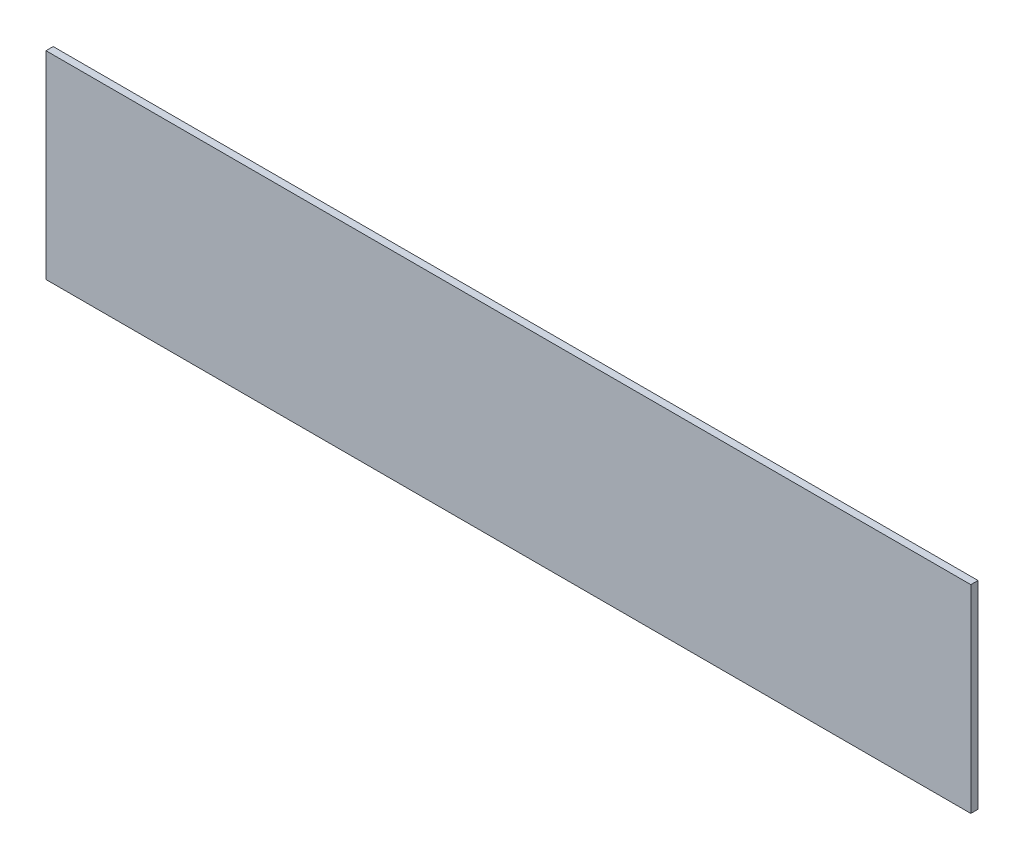
ISO-10303-21;
HEADER;
FILE_DESCRIPTION(('STEP AP214'),'2;1');
FILE_NAME('part.step','',(''),(''),'','','');
FILE_SCHEMA(('AUTOMOTIVE_DESIGN { 1 0 10303 214 1 1 1 1 }'));
ENDSEC;
DATA;
#1=APPLICATION_CONTEXT('core data for automotive mechanical design processes');
#2=APPLICATION_PROTOCOL_DEFINITION('international standard','automotive_design',2000,#1);
#3=PRODUCT_CONTEXT('',#1,'mechanical');
#4=PRODUCT('Part','Part','',(#3));
#5=PRODUCT_RELATED_PRODUCT_CATEGORY('part','',(#4));
#6=PRODUCT_DEFINITION_FORMATION('','',#4);
#7=PRODUCT_DEFINITION_CONTEXT('part definition',#1,'design');
#8=PRODUCT_DEFINITION('design','',#6,#7);
#9=PRODUCT_DEFINITION_SHAPE('','',#8);
#10=(LENGTH_UNIT() NAMED_UNIT(*) SI_UNIT(.MILLI.,.METRE.));
#11=(NAMED_UNIT(*) PLANE_ANGLE_UNIT() SI_UNIT($,.RADIAN.));
#12=(NAMED_UNIT(*) SI_UNIT($,.STERADIAN.) SOLID_ANGLE_UNIT());
#13=UNCERTAINTY_MEASURE_WITH_UNIT(LENGTH_MEASURE(1.E-05),#10,'distance_accuracy_value','');
#14=(GEOMETRIC_REPRESENTATION_CONTEXT(3) GLOBAL_UNCERTAINTY_ASSIGNED_CONTEXT((#13)) GLOBAL_UNIT_ASSIGNED_CONTEXT((#10,
#11,#12)) REPRESENTATION_CONTEXT('',''));
#15=CARTESIAN_POINT('',(0.,0.,0.));
#16=DIRECTION('',(0.,0.,1.));
#17=DIRECTION('',(1.,0.,0.));
#18=AXIS2_PLACEMENT_3D('',#15,#16,#17);
#19=CARTESIAN_POINT('',(0.,0.,3.));
#20=DIRECTION('',(1.,0.,0.));
#21=DIRECTION('',(0.,0.,-1.));
#22=AXIS2_PLACEMENT_3D('',#19,#20,#21);
#23=PLANE('',#22);
#24=DIRECTION('',(0.,-1.,0.));
#25=VECTOR('',#24,1.);
#26=CARTESIAN_POINT('',(0.,0.,0.));
#27=LINE('',#26,#25);
#28=CARTESIAN_POINT('',(0.,82.5,0.));
#29=VERTEX_POINT('',#28);
#30=CARTESIAN_POINT('',(0.,0.,0.));
#31=VERTEX_POINT('',#30);
#32=EDGE_CURVE('E97',#29,#31,#27,.T.);
#33=ORIENTED_EDGE('',*,*,#32,.T.);
#34=DIRECTION('',(0.,0.,-1.));
#35=VECTOR('',#34,1.);
#36=CARTESIAN_POINT('',(0.,0.,3.));
#37=LINE('',#36,#35);
#38=CARTESIAN_POINT('',(0.,0.,3.));
#39=VERTEX_POINT('',#38);
#40=EDGE_CURVE('E11',#39,#31,#37,.T.);
#41=ORIENTED_EDGE('',*,*,#40,.F.);
#42=DIRECTION('',(0.,-1.,0.));
#43=VECTOR('',#42,1.);
#44=CARTESIAN_POINT('',(0.,0.,3.));
#45=LINE('',#44,#43);
#46=CARTESIAN_POINT('',(0.,82.5,3.));
#47=VERTEX_POINT('',#46);
#48=EDGE_CURVE('E85',#47,#39,#45,.T.);
#49=ORIENTED_EDGE('',*,*,#48,.F.);
#50=DIRECTION('',(0.,0.,-1.));
#51=VECTOR('',#50,1.);
#52=CARTESIAN_POINT('',(0.,82.5,3.));
#53=LINE('',#52,#51);
#54=EDGE_CURVE('E93',#47,#29,#53,.T.);
#55=ORIENTED_EDGE('',*,*,#54,.T.);
#56=EDGE_LOOP('',(#33,#41,#49,#55));
#57=FACE_BOUND('',#56,.T.);
#58=ADVANCED_FACE('F34',(#57),#23,.F.);
#59=CARTESIAN_POINT('',(0.,0.,3.));
#60=DIRECTION('',(0.,1.,0.));
#61=DIRECTION('',(0.,0.,1.));
#62=AXIS2_PLACEMENT_3D('',#59,#60,#61);
#63=PLANE('',#62);
#64=DIRECTION('',(1.,0.,0.));
#65=VECTOR('',#64,1.);
#66=CARTESIAN_POINT('',(0.,0.,0.));
#67=LINE('',#66,#65);
#68=CARTESIAN_POINT('',(385.,0.,0.));
#69=VERTEX_POINT('',#68);
#70=EDGE_CURVE('E89',#31,#69,#67,.T.);
#71=ORIENTED_EDGE('',*,*,#70,.T.);
#72=DIRECTION('',(0.,0.,-1.));
#73=VECTOR('',#72,1.);
#74=CARTESIAN_POINT('',(385.,0.,3.));
#75=LINE('',#74,#73);
#76=CARTESIAN_POINT('',(385.,0.,3.));
#77=VERTEX_POINT('',#76);
#78=EDGE_CURVE('E42',#77,#69,#75,.T.);
#79=ORIENTED_EDGE('',*,*,#78,.F.);
#80=DIRECTION('',(1.,0.,0.));
#81=VECTOR('',#80,1.);
#82=CARTESIAN_POINT('',(0.,0.,3.));
#83=LINE('',#82,#81);
#84=EDGE_CURVE('E80',#39,#77,#83,.T.);
#85=ORIENTED_EDGE('',*,*,#84,.F.);
#86=ORIENTED_EDGE('',*,*,#40,.T.);
#87=EDGE_LOOP('',(#71,#79,#85,#86));
#88=FACE_BOUND('',#87,.T.);
#89=ADVANCED_FACE('F88',(#88),#63,.F.);
#90=CARTESIAN_POINT('',(385.,0.,3.));
#91=DIRECTION('',(-1.,0.,0.));
#92=DIRECTION('',(0.,0.,1.));
#93=AXIS2_PLACEMENT_3D('',#90,#91,#92);
#94=PLANE('',#93);
#95=DIRECTION('',(0.,1.,0.));
#96=VECTOR('',#95,1.);
#97=CARTESIAN_POINT('',(385.,0.,0.));
#98=LINE('',#97,#96);
#99=CARTESIAN_POINT('',(385.,82.5,0.));
#100=VERTEX_POINT('',#99);
#101=EDGE_CURVE('E67',#69,#100,#98,.T.);
#102=ORIENTED_EDGE('',*,*,#101,.T.);
#103=DIRECTION('',(0.,0.,-1.));
#104=VECTOR('',#103,1.);
#105=CARTESIAN_POINT('',(385.,82.5,3.));
#106=LINE('',#105,#104);
#107=CARTESIAN_POINT('',(385.,82.5,3.));
#108=VERTEX_POINT('',#107);
#109=EDGE_CURVE('E90',#108,#100,#106,.T.);
#110=ORIENTED_EDGE('',*,*,#109,.F.);
#111=DIRECTION('',(0.,1.,0.));
#112=VECTOR('',#111,1.);
#113=CARTESIAN_POINT('',(385.,0.,3.));
#114=LINE('',#113,#112);
#115=EDGE_CURVE('E83',#77,#108,#114,.T.);
#116=ORIENTED_EDGE('',*,*,#115,.F.);
#117=ORIENTED_EDGE('',*,*,#78,.T.);
#118=EDGE_LOOP('',(#102,#110,#116,#117));
#119=FACE_BOUND('',#118,.T.);
#120=ADVANCED_FACE('F91',(#119),#94,.F.);
#121=CARTESIAN_POINT('',(0.,82.5,3.));
#122=DIRECTION('',(0.,-1.,0.));
#123=DIRECTION('',(0.,0.,-1.));
#124=AXIS2_PLACEMENT_3D('',#121,#122,#123);
#125=PLANE('',#124);
#126=DIRECTION('',(-1.,0.,0.));
#127=VECTOR('',#126,1.);
#128=CARTESIAN_POINT('',(0.,82.5,0.));
#129=LINE('',#128,#127);
#130=EDGE_CURVE('E73',#100,#29,#129,.T.);
#131=ORIENTED_EDGE('',*,*,#130,.T.);
#132=ORIENTED_EDGE('',*,*,#54,.F.);
#133=DIRECTION('',(-1.,0.,0.));
#134=VECTOR('',#133,1.);
#135=CARTESIAN_POINT('',(0.,82.5,3.));
#136=LINE('',#135,#134);
#137=EDGE_CURVE('E50',#108,#47,#136,.T.);
#138=ORIENTED_EDGE('',*,*,#137,.F.);
#139=ORIENTED_EDGE('',*,*,#109,.T.);
#140=EDGE_LOOP('',(#131,#132,#138,#139));
#141=FACE_BOUND('',#140,.T.);
#142=ADVANCED_FACE('F104',(#141),#125,.F.);
#143=CARTESIAN_POINT('',(0.,0.,3.));
#144=DIRECTION('',(0.,0.,-1.));
#145=DIRECTION('',(-1.,0.,0.));
#146=AXIS2_PLACEMENT_3D('',#143,#144,#145);
#147=PLANE('',#146);
#148=ORIENTED_EDGE('',*,*,#48,.T.);
#149=ORIENTED_EDGE('',*,*,#84,.T.);
#150=ORIENTED_EDGE('',*,*,#115,.T.);
#151=ORIENTED_EDGE('',*,*,#137,.T.);
#152=EDGE_LOOP('',(#148,#149,#150,#151));
#153=FACE_BOUND('',#152,.T.);
#154=ADVANCED_FACE('F81',(#153),#147,.F.);
#155=CARTESIAN_POINT('',(0.,0.,0.));
#156=DIRECTION('',(0.,0.,-1.));
#157=DIRECTION('',(-1.,0.,0.));
#158=AXIS2_PLACEMENT_3D('',#155,#156,#157);
#159=PLANE('',#158);
#160=ORIENTED_EDGE('',*,*,#32,.F.);
#161=ORIENTED_EDGE('',*,*,#130,.F.);
#162=ORIENTED_EDGE('',*,*,#101,.F.);
#163=ORIENTED_EDGE('',*,*,#70,.F.);
#164=EDGE_LOOP('',(#160,#161,#162,#163));
#165=FACE_BOUND('',#164,.T.);
#166=ADVANCED_FACE('F107',(#165),#159,.T.);
#167=CLOSED_SHELL('',(#58,#89,#120,#142,#154,#166));
#168=MANIFOLD_SOLID_BREP('B2',#167);
#169=ADVANCED_BREP_SHAPE_REPRESENTATION('',(#18,#168),#14);
#170=SHAPE_DEFINITION_REPRESENTATION(#9,#169);
ENDSEC;
END-ISO-10303-21;
